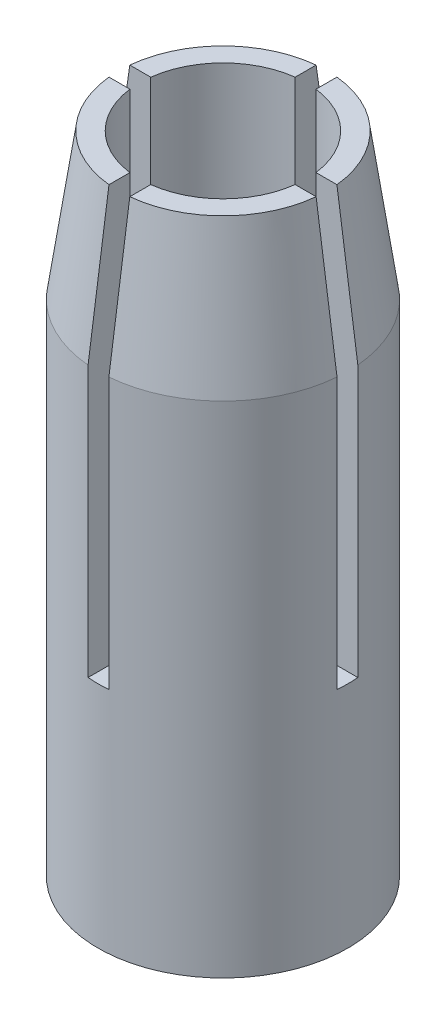
ISO-10303-21;
HEADER;
FILE_DESCRIPTION(('STEP AP214'),'2;1');
FILE_NAME('part.step','',(''),(''),'','','');
FILE_SCHEMA(('AUTOMOTIVE_DESIGN { 1 0 10303 214 1 1 1 1 }'));
ENDSEC;
DATA;
#1=APPLICATION_CONTEXT('core data for automotive mechanical design processes');
#2=APPLICATION_PROTOCOL_DEFINITION('international standard','automotive_design',2000,#1);
#3=PRODUCT_CONTEXT('',#1,'mechanical');
#4=PRODUCT('Part','Part','',(#3));
#5=PRODUCT_RELATED_PRODUCT_CATEGORY('part','',(#4));
#6=PRODUCT_DEFINITION_FORMATION('','',#4);
#7=PRODUCT_DEFINITION_CONTEXT('part definition',#1,'design');
#8=PRODUCT_DEFINITION('design','',#6,#7);
#9=PRODUCT_DEFINITION_SHAPE('','',#8);
#10=(LENGTH_UNIT() NAMED_UNIT(*) SI_UNIT(.MILLI.,.METRE.));
#11=(NAMED_UNIT(*) PLANE_ANGLE_UNIT() SI_UNIT($,.RADIAN.));
#12=(NAMED_UNIT(*) SI_UNIT($,.STERADIAN.) SOLID_ANGLE_UNIT());
#13=UNCERTAINTY_MEASURE_WITH_UNIT(LENGTH_MEASURE(1.E-05),#10,'distance_accuracy_value','');
#14=(GEOMETRIC_REPRESENTATION_CONTEXT(3) GLOBAL_UNCERTAINTY_ASSIGNED_CONTEXT((#13)) GLOBAL_UNIT_ASSIGNED_CONTEXT((#10,
#11,#12)) REPRESENTATION_CONTEXT('',''));
#15=CARTESIAN_POINT('',(0.,0.,0.));
#16=DIRECTION('',(0.,0.,1.));
#17=DIRECTION('',(1.,0.,0.));
#18=AXIS2_PLACEMENT_3D('',#15,#16,#17);
#19=CARTESIAN_POINT('',(0.,5.5,0.));
#20=DIRECTION('',(0.,1.,0.));
#21=DIRECTION('',(0.,0.,1.));
#22=AXIS2_PLACEMENT_3D('',#19,#20,#21);
#23=PLANE('',#22);
#24=CARTESIAN_POINT('',(0.,5.5,0.));
#25=DIRECTION('',(0.,1.,0.));
#26=DIRECTION('',(0.,0.,1.));
#27=AXIS2_PLACEMENT_3D('',#24,#25,#26);
#28=CIRCLE('',#27,2.);
#29=CARTESIAN_POINT('',(1.98431348329844,5.5,0.25));
#30=VERTEX_POINT('',#29);
#31=CARTESIAN_POINT('',(1.98431348329844,5.5,-0.249999999999999));
#32=VERTEX_POINT('',#31);
#33=EDGE_CURVE('E11',#30,#32,#28,.T.);
#34=ORIENTED_EDGE('',*,*,#33,.F.);
#35=DIRECTION('',(1.,0.,0.));
#36=VECTOR('',#35,1.);
#37=CARTESIAN_POINT('',(6.25,5.5,0.25));
#38=LINE('',#37,#36);
#39=CARTESIAN_POINT('',(2.98956518577535,5.5,0.25));
#40=VERTEX_POINT('',#39);
#41=EDGE_CURVE('E326',#30,#40,#38,.T.);
#42=ORIENTED_EDGE('',*,*,#41,.T.);
#43=CARTESIAN_POINT('',(0.,5.5,0.));
#44=DIRECTION('',(0.,1.,0.));
#45=DIRECTION('',(0.,0.,1.));
#46=AXIS2_PLACEMENT_3D('',#43,#44,#45);
#47=CIRCLE('',#46,3.);
#48=CARTESIAN_POINT('',(2.98956518577535,5.5,-0.249999999999999));
#49=VERTEX_POINT('',#48);
#50=EDGE_CURVE('E278',#49,#40,#47,.F.);
#51=ORIENTED_EDGE('',*,*,#50,.F.);
#52=DIRECTION('',(-1.,0.,0.));
#53=VECTOR('',#52,1.);
#54=CARTESIAN_POINT('',(0.25,5.5,-0.25));
#55=LINE('',#54,#53);
#56=EDGE_CURVE('E204',#49,#32,#55,.T.);
#57=ORIENTED_EDGE('',*,*,#56,.T.);
#58=EDGE_LOOP('',(#34,#42,#51,#57));
#59=FACE_BOUND('',#58,.T.);
#60=ADVANCED_FACE('F34',(#59),#23,.T.);
#61=CARTESIAN_POINT('',(0.25,5.5,-1.98431348329844));
#62=VERTEX_POINT('',#61);
#63=CARTESIAN_POINT('',(-0.249999999999999,5.5,-1.98431348329844));
#64=VERTEX_POINT('',#63);
#65=EDGE_CURVE('E43',#62,#64,#28,.T.);
#66=ORIENTED_EDGE('',*,*,#65,.F.);
#67=DIRECTION('',(0.,0.,-1.));
#68=VECTOR('',#67,1.);
#69=CARTESIAN_POINT('',(0.25,5.5,-6.25));
#70=LINE('',#69,#68);
#71=CARTESIAN_POINT('',(0.25,5.5,-2.98956518577535));
#72=VERTEX_POINT('',#71);
#73=EDGE_CURVE('E189',#62,#72,#70,.T.);
#74=ORIENTED_EDGE('',*,*,#73,.T.);
#75=CARTESIAN_POINT('',(-0.249999999999999,5.5,-2.98956518577535));
#76=VERTEX_POINT('',#75);
#77=EDGE_CURVE('E287',#76,#72,#47,.F.);
#78=ORIENTED_EDGE('',*,*,#77,.F.);
#79=DIRECTION('',(0.,0.,1.));
#80=VECTOR('',#79,1.);
#81=CARTESIAN_POINT('',(-0.249999999999999,5.5,-0.25));
#82=LINE('',#81,#80);
#83=EDGE_CURVE('E308',#76,#64,#82,.T.);
#84=ORIENTED_EDGE('',*,*,#83,.T.);
#85=EDGE_LOOP('',(#66,#74,#78,#84));
#86=FACE_BOUND('',#85,.T.);
#87=ADVANCED_FACE('F313',(#86),#23,.T.);
#88=CARTESIAN_POINT('',(-1.98431348329844,5.5,-0.249999999999999));
#89=VERTEX_POINT('',#88);
#90=CARTESIAN_POINT('',(-1.98431348329844,5.5,0.25));
#91=VERTEX_POINT('',#90);
#92=EDGE_CURVE('E299',#89,#91,#28,.T.);
#93=ORIENTED_EDGE('',*,*,#92,.F.);
#94=DIRECTION('',(-1.,0.,0.));
#95=VECTOR('',#94,1.);
#96=CARTESIAN_POINT('',(-6.25,5.5,-0.249999999999999));
#97=LINE('',#96,#95);
#98=CARTESIAN_POINT('',(-2.98956518577535,5.5,-0.249999999999999));
#99=VERTEX_POINT('',#98);
#100=EDGE_CURVE('E315',#89,#99,#97,.T.);
#101=ORIENTED_EDGE('',*,*,#100,.T.);
#102=CARTESIAN_POINT('',(-2.98956518577535,5.5,0.250000000000001));
#103=VERTEX_POINT('',#102);
#104=EDGE_CURVE('E277',#103,#99,#47,.F.);
#105=ORIENTED_EDGE('',*,*,#104,.F.);
#106=DIRECTION('',(1.,0.,0.));
#107=VECTOR('',#106,1.);
#108=CARTESIAN_POINT('',(-0.249999999999999,5.5,0.25));
#109=LINE('',#108,#107);
#110=EDGE_CURVE('E317',#103,#91,#109,.T.);
#111=ORIENTED_EDGE('',*,*,#110,.T.);
#112=EDGE_LOOP('',(#93,#101,#105,#111));
#113=FACE_BOUND('',#112,.T.);
#114=ADVANCED_FACE('F428',(#113),#23,.T.);
#115=CARTESIAN_POINT('',(0.,15.5,0.));
#116=DIRECTION('',(0.,1.,0.));
#117=DIRECTION('',(0.,0.,1.));
#118=AXIS2_PLACEMENT_3D('',#115,#116,#117);
#119=PLANE('',#118);
#120=CARTESIAN_POINT('',(0.,15.5,0.));
#121=DIRECTION('',(0.,-1.,0.));
#122=DIRECTION('',(0.,0.,-1.));
#123=AXIS2_PLACEMENT_3D('',#120,#121,#122);
#124=CIRCLE('',#123,2.);
#125=CARTESIAN_POINT('',(0.25,15.5,-1.98431348329844));
#126=VERTEX_POINT('',#125);
#127=CARTESIAN_POINT('',(1.98431348329844,15.5,-0.249999999999999));
#128=VERTEX_POINT('',#127);
#129=EDGE_CURVE('E169',#126,#128,#124,.T.);
#130=ORIENTED_EDGE('',*,*,#129,.T.);
#131=DIRECTION('',(-1.,0.,0.));
#132=VECTOR('',#131,1.);
#133=CARTESIAN_POINT('',(0.25,15.5,-0.25));
#134=LINE('',#133,#132);
#135=CARTESIAN_POINT('',(2.48746859276655,15.5,-0.249999999999999));
#136=VERTEX_POINT('',#135);
#137=EDGE_CURVE('E218',#136,#128,#134,.T.);
#138=ORIENTED_EDGE('',*,*,#137,.F.);
#139=CARTESIAN_POINT('',(0.,15.5,0.));
#140=DIRECTION('',(0.,-1.,0.));
#141=DIRECTION('',(0.,0.,-1.));
#142=AXIS2_PLACEMENT_3D('',#139,#140,#141);
#143=CIRCLE('',#142,2.5);
#144=CARTESIAN_POINT('',(0.25,15.5,-2.48746859276655));
#145=VERTEX_POINT('',#144);
#146=EDGE_CURVE('E196',#145,#136,#143,.T.);
#147=ORIENTED_EDGE('',*,*,#146,.F.);
#148=DIRECTION('',(0.,0.,-1.));
#149=VECTOR('',#148,1.);
#150=CARTESIAN_POINT('',(0.25,15.5,-6.25));
#151=LINE('',#150,#149);
#152=EDGE_CURVE('E186',#126,#145,#151,.T.);
#153=ORIENTED_EDGE('',*,*,#152,.F.);
#154=EDGE_LOOP('',(#130,#138,#147,#153));
#155=FACE_BOUND('',#154,.T.);
#156=ADVANCED_FACE('F194',(#155),#119,.T.);
#157=CARTESIAN_POINT('',(1.98431348329844,15.5,0.25));
#158=VERTEX_POINT('',#157);
#159=CARTESIAN_POINT('',(0.25,15.5,1.98431348329844));
#160=VERTEX_POINT('',#159);
#161=EDGE_CURVE('E180',#158,#160,#124,.T.);
#162=ORIENTED_EDGE('',*,*,#161,.T.);
#163=DIRECTION('',(0.,0.,-1.));
#164=VECTOR('',#163,1.);
#165=CARTESIAN_POINT('',(0.25,15.5,0.25));
#166=LINE('',#165,#164);
#167=CARTESIAN_POINT('',(0.25,15.5,2.48746859276655));
#168=VERTEX_POINT('',#167);
#169=EDGE_CURVE('E213',#168,#160,#166,.T.);
#170=ORIENTED_EDGE('',*,*,#169,.F.);
#171=CARTESIAN_POINT('',(2.48746859276655,15.5,0.25));
#172=VERTEX_POINT('',#171);
#173=EDGE_CURVE('E273',#172,#168,#143,.T.);
#174=ORIENTED_EDGE('',*,*,#173,.F.);
#175=DIRECTION('',(1.,0.,0.));
#176=VECTOR('',#175,1.);
#177=CARTESIAN_POINT('',(6.25,15.5,0.25));
#178=LINE('',#177,#176);
#179=EDGE_CURVE('E216',#158,#172,#178,.T.);
#180=ORIENTED_EDGE('',*,*,#179,.F.);
#181=EDGE_LOOP('',(#162,#170,#174,#180));
#182=FACE_BOUND('',#181,.T.);
#183=ADVANCED_FACE('F412',(#182),#119,.T.);
#184=CARTESIAN_POINT('',(-0.249999999999999,15.5,1.98431348329844));
#185=VERTEX_POINT('',#184);
#186=CARTESIAN_POINT('',(-1.98431348329844,15.5,0.25));
#187=VERTEX_POINT('',#186);
#188=EDGE_CURVE('E415',#185,#187,#124,.T.);
#189=ORIENTED_EDGE('',*,*,#188,.T.);
#190=DIRECTION('',(1.,0.,0.));
#191=VECTOR('',#190,1.);
#192=CARTESIAN_POINT('',(-0.249999999999999,15.5,0.25));
#193=LINE('',#192,#191);
#194=CARTESIAN_POINT('',(-2.48746859276655,15.5,0.250000000000001));
#195=VERTEX_POINT('',#194);
#196=EDGE_CURVE('E208',#195,#187,#193,.T.);
#197=ORIENTED_EDGE('',*,*,#196,.F.);
#198=CARTESIAN_POINT('',(-0.249999999999999,15.5,2.48746859276655));
#199=VERTEX_POINT('',#198);
#200=EDGE_CURVE('E430',#199,#195,#143,.T.);
#201=ORIENTED_EDGE('',*,*,#200,.F.);
#202=DIRECTION('',(0.,0.,1.));
#203=VECTOR('',#202,1.);
#204=CARTESIAN_POINT('',(-0.249999999999999,15.5,6.25));
#205=LINE('',#204,#203);
#206=EDGE_CURVE('E211',#185,#199,#205,.T.);
#207=ORIENTED_EDGE('',*,*,#206,.F.);
#208=EDGE_LOOP('',(#189,#197,#201,#207));
#209=FACE_BOUND('',#208,.T.);
#210=ADVANCED_FACE('F438',(#209),#119,.T.);
#211=CARTESIAN_POINT('',(0.,12.,0.));
#212=DIRECTION('',(0.,-1.,0.));
#213=DIRECTION('',(0.,0.,-1.));
#214=AXIS2_PLACEMENT_3D('',#211,#212,#213);
#215=CONICAL_SURFACE('',#214,3.,0.141897054604164);
#216=CARTESIAN_POINT('',(0.25,17.5974181034012,-2.18612054619095));
#217=CARTESIAN_POINT('',(0.25,16.3253345447487,-2.36900749170544));
#218=CARTESIAN_POINT('',(0.25,15.0532172360124,-2.55165936364087));
#219=CARTESIAN_POINT('',(0.25,13.3620493745075,-2.79426649400318));
#220=CARTESIAN_POINT('',(0.25,12.9430188500199,-2.85436134005573));
#221=CARTESIAN_POINT('',(0.25,10.8328004035789,-3.15692332874558));
#222=CARTESIAN_POINT('',(0.25,9.14158138153774,-3.39917363737321));
#223=CARTESIAN_POINT('',(0.25,7.45035573658055,-3.64137735206729));
#224=B_SPLINE_CURVE_WITH_KNOTS('',3,(#216,#217,#218,#219,#220,#221,#222,#223),.UNSPECIFIED.,.F.,
.F.,(4,2,2,4),(0.,3.85548924063714,5.12544267930526,10.2508852950475),.UNSPECIFIED.);
#225=CARTESIAN_POINT('',(0.25,12.,-2.98956518577535));
#226=VERTEX_POINT('',#225);
#227=EDGE_CURVE('E250',#145,#226,#224,.T.);
#228=ORIENTED_EDGE('',*,*,#227,.F.);
#229=ORIENTED_EDGE('',*,*,#146,.T.);
#230=CARTESIAN_POINT('',(3.64137735206729,7.45035573658055,-0.249999999999999));
#231=CARTESIAN_POINT('',(3.52028937255365,8.29597056504085,-0.249999999999999));
#232=CARTESIAN_POINT('',(3.39917658861142,9.14158184315956,-0.249999999999999));
#233=CARTESIAN_POINT('',(3.1568739578554,10.8327933417464,-0.249999999999999));
#234=CARTESIAN_POINT('',(3.03568411104306,11.6783935622148,-0.249999999999999));
#235=CARTESIAN_POINT('',(2.79319989441477,13.3695790312572,-0.249999999999999));
#236=CARTESIAN_POINT('',(2.67190552459748,14.215164279831,-0.249999999999999));
#237=CARTESIAN_POINT('',(2.4291518444079,15.9063111155802,-0.249999999999999));
#238=CARTESIAN_POINT('',(2.3076925340324,16.7518727027551,-0.249999999999999));
#239=CARTESIAN_POINT('',(2.18612054619095,17.5974181034012,-0.249999999999999));
#240=B_SPLINE_CURVE_WITH_KNOTS('',3,(#230,#231,#232,#233,#234,#235,#236,#237,#238,#239),
.UNSPECIFIED.,.F.,.F.,(4,2,2,2,4),(0.,2.56272133473702,5.12544262106358,7.6881639400474,
10.2508853089314),.UNSPECIFIED.);
#241=CARTESIAN_POINT('',(2.98956518577535,12.,-0.249999999999999));
#242=VERTEX_POINT('',#241);
#243=EDGE_CURVE('E257',#242,#136,#240,.T.);
#244=ORIENTED_EDGE('',*,*,#243,.F.);
#245=CARTESIAN_POINT('',(0.,12.,0.));
#246=DIRECTION('',(0.,-1.,0.));
#247=DIRECTION('',(0.,0.,-1.));
#248=AXIS2_PLACEMENT_3D('',#245,#246,#247);
#249=CIRCLE('',#248,3.);
#250=EDGE_CURVE('E266',#226,#242,#249,.T.);
#251=ORIENTED_EDGE('',*,*,#250,.F.);
#252=EDGE_LOOP('',(#228,#229,#244,#251));
#253=FACE_BOUND('',#252,.T.);
#254=ADVANCED_FACE('F343',(#253),#215,.T.);
#255=CARTESIAN_POINT('',(2.18612054619095,17.5974181034012,0.25));
#256=CARTESIAN_POINT('',(2.36900749170544,16.3253345447487,0.25));
#257=CARTESIAN_POINT('',(2.55165936364087,15.0532172360124,0.25));
#258=CARTESIAN_POINT('',(2.79426649400318,13.3620493745075,0.25));
#259=CARTESIAN_POINT('',(2.85436134005573,12.9430188500199,0.25));
#260=CARTESIAN_POINT('',(3.15692332874558,10.8328004035789,0.25));
#261=CARTESIAN_POINT('',(3.39917363737321,9.14158138153774,0.25));
#262=CARTESIAN_POINT('',(3.64137735206729,7.45035573658055,0.25));
#263=B_SPLINE_CURVE_WITH_KNOTS('',3,(#255,#256,#257,#258,#259,#260,#261,#262),.UNSPECIFIED.,.F.,
.F.,(4,2,2,4),(0.,3.85548924063714,5.12544267930526,10.2508852950475),.UNSPECIFIED.);
#264=CARTESIAN_POINT('',(2.98956518577535,12.,0.25));
#265=VERTEX_POINT('',#264);
#266=EDGE_CURVE('E344',#172,#265,#263,.T.);
#267=ORIENTED_EDGE('',*,*,#266,.F.);
#268=ORIENTED_EDGE('',*,*,#173,.T.);
#269=CARTESIAN_POINT('',(0.25,7.45035573658055,3.64137735206729));
#270=CARTESIAN_POINT('',(0.25,8.29597056504085,3.52028937255365));
#271=CARTESIAN_POINT('',(0.25,9.14158184315956,3.39917658861142));
#272=CARTESIAN_POINT('',(0.25,10.8327933417464,3.1568739578554));
#273=CARTESIAN_POINT('',(0.25,11.6783935622148,3.03568411104306));
#274=CARTESIAN_POINT('',(0.25,13.3695790312572,2.79319989441477));
#275=CARTESIAN_POINT('',(0.25,14.215164279831,2.67190552459748));
#276=CARTESIAN_POINT('',(0.25,15.9063111155802,2.4291518444079));
#277=CARTESIAN_POINT('',(0.25,16.7518727027551,2.3076925340324));
#278=CARTESIAN_POINT('',(0.25,17.5974181034012,2.18612054619095));
#279=B_SPLINE_CURVE_WITH_KNOTS('',3,(#269,#270,#271,#272,#273,#274,#275,#276,#277,#278),
.UNSPECIFIED.,.F.,.F.,(4,2,2,2,4),(0.,2.56272133473702,5.12544262106358,7.6881639400474,
10.2508853089314),.UNSPECIFIED.);
#280=CARTESIAN_POINT('',(0.25,12.,2.98956518577535));
#281=VERTEX_POINT('',#280);
#282=EDGE_CURVE('E345',#281,#168,#279,.T.);
#283=ORIENTED_EDGE('',*,*,#282,.F.);
#284=EDGE_CURVE('E270',#265,#281,#249,.T.);
#285=ORIENTED_EDGE('',*,*,#284,.F.);
#286=EDGE_LOOP('',(#267,#268,#283,#285));
#287=FACE_BOUND('',#286,.T.);
#288=ADVANCED_FACE('F405',(#287),#215,.T.);
#289=CARTESIAN_POINT('',(-0.249999999999999,17.5974181034012,2.18612054619095));
#290=CARTESIAN_POINT('',(-0.249999999999999,16.3253345447487,2.36900749170544));
#291=CARTESIAN_POINT('',(-0.249999999999999,15.0532172360124,2.55165936364087));
#292=CARTESIAN_POINT('',(-0.249999999999999,13.3620493745075,2.79426649400318));
#293=CARTESIAN_POINT('',(-0.249999999999999,12.9430188500199,2.85436134005573));
#294=CARTESIAN_POINT('',(-0.249999999999999,10.8328004035789,3.15692332874558));
#295=CARTESIAN_POINT('',(-0.249999999999999,9.14158138153774,3.39917363737321));
#296=CARTESIAN_POINT('',(-0.249999999999999,7.45035573658055,3.64137735206729));
#297=B_SPLINE_CURVE_WITH_KNOTS('',3,(#289,#290,#291,#292,#293,#294,#295,#296),.UNSPECIFIED.,.F.,
.F.,(4,2,2,4),(0.,3.85548924063714,5.12544267930526,10.2508852950475),.UNSPECIFIED.);
#298=CARTESIAN_POINT('',(-0.249999999999999,12.,2.98956518577535));
#299=VERTEX_POINT('',#298);
#300=EDGE_CURVE('E348',#199,#299,#297,.T.);
#301=ORIENTED_EDGE('',*,*,#300,.F.);
#302=ORIENTED_EDGE('',*,*,#200,.T.);
#303=CARTESIAN_POINT('',(-3.64137735206729,7.45035573658055,0.250000000000001));
#304=CARTESIAN_POINT('',(-3.52028937255365,8.29597056504085,0.250000000000001));
#305=CARTESIAN_POINT('',(-3.39917658861142,9.14158184315956,0.250000000000001));
#306=CARTESIAN_POINT('',(-3.1568739578554,10.8327933417464,0.250000000000001));
#307=CARTESIAN_POINT('',(-3.03568411104306,11.6783935622148,0.250000000000001));
#308=CARTESIAN_POINT('',(-2.79319989441477,13.3695790312572,0.250000000000001));
#309=CARTESIAN_POINT('',(-2.67190552459748,14.215164279831,0.250000000000001));
#310=CARTESIAN_POINT('',(-2.4291518444079,15.9063111155802,0.250000000000001));
#311=CARTESIAN_POINT('',(-2.3076925340324,16.7518727027551,0.250000000000001));
#312=CARTESIAN_POINT('',(-2.18612054619095,17.5974181034012,0.25));
#313=B_SPLINE_CURVE_WITH_KNOTS('',3,(#303,#304,#305,#306,#307,#308,#309,#310,#311,#312),
.UNSPECIFIED.,.F.,.F.,(4,2,2,2,4),(0.,2.56272133473702,5.12544262106358,7.6881639400474,
10.2508853089314),.UNSPECIFIED.);
#314=CARTESIAN_POINT('',(-2.98956518577535,12.,0.250000000000001));
#315=VERTEX_POINT('',#314);
#316=EDGE_CURVE('E378',#315,#195,#313,.T.);
#317=ORIENTED_EDGE('',*,*,#316,.F.);
#318=EDGE_CURVE('E396',#299,#315,#249,.T.);
#319=ORIENTED_EDGE('',*,*,#318,.F.);
#320=EDGE_LOOP('',(#301,#302,#317,#319));
#321=FACE_BOUND('',#320,.T.);
#322=ADVANCED_FACE('F435',(#321),#215,.T.);
#323=CARTESIAN_POINT('',(-1.98431348329844,15.5,-0.249999999999999));
#324=VERTEX_POINT('',#323);
#325=CARTESIAN_POINT('',(-0.249999999999999,15.5,-1.98431348329844));
#326=VERTEX_POINT('',#325);
#327=EDGE_CURVE('E182',#324,#326,#124,.T.);
#328=ORIENTED_EDGE('',*,*,#327,.T.);
#329=DIRECTION('',(0.,0.,1.));
#330=VECTOR('',#329,1.);
#331=CARTESIAN_POINT('',(-0.249999999999999,15.5,-0.25));
#332=LINE('',#331,#330);
#333=CARTESIAN_POINT('',(-0.249999999999999,15.5,-2.48746859276655));
#334=VERTEX_POINT('',#333);
#335=EDGE_CURVE('E197',#334,#326,#332,.T.);
#336=ORIENTED_EDGE('',*,*,#335,.F.);
#337=CARTESIAN_POINT('',(-2.48746859276655,15.5,-0.249999999999999));
#338=VERTEX_POINT('',#337);
#339=EDGE_CURVE('E269',#338,#334,#143,.T.);
#340=ORIENTED_EDGE('',*,*,#339,.F.);
#341=DIRECTION('',(-1.,0.,0.));
#342=VECTOR('',#341,1.);
#343=CARTESIAN_POINT('',(-6.25,15.5,-0.249999999999999));
#344=LINE('',#343,#342);
#345=EDGE_CURVE('E200',#324,#338,#344,.T.);
#346=ORIENTED_EDGE('',*,*,#345,.F.);
#347=EDGE_LOOP('',(#328,#336,#340,#346));
#348=FACE_BOUND('',#347,.T.);
#349=ADVANCED_FACE('F36',(#348),#119,.T.);
#350=CARTESIAN_POINT('',(-2.18612054619095,17.5974181034012,-0.249999999999999));
#351=CARTESIAN_POINT('',(-2.36900749170544,16.3253345447487,-0.249999999999999));
#352=CARTESIAN_POINT('',(-2.55165936364087,15.0532172360124,-0.249999999999999));
#353=CARTESIAN_POINT('',(-2.79426649400318,13.3620493745075,-0.249999999999999));
#354=CARTESIAN_POINT('',(-2.85436134005573,12.9430188500199,-0.249999999999999));
#355=CARTESIAN_POINT('',(-3.15692332874558,10.8328004035789,-0.249999999999999));
#356=CARTESIAN_POINT('',(-3.39917363737321,9.14158138153774,-0.249999999999999));
#357=CARTESIAN_POINT('',(-3.64137735206729,7.45035573658055,-0.249999999999999));
#358=B_SPLINE_CURVE_WITH_KNOTS('',3,(#350,#351,#352,#353,#354,#355,#356,#357),.UNSPECIFIED.,.F.,
.F.,(4,2,2,4),(0.,3.85548924063714,5.12544267930526,10.2508852950475),.UNSPECIFIED.);
#359=CARTESIAN_POINT('',(-2.98956518577535,12.,-0.249999999999999));
#360=VERTEX_POINT('',#359);
#361=EDGE_CURVE('E226',#338,#360,#358,.T.);
#362=ORIENTED_EDGE('',*,*,#361,.F.);
#363=ORIENTED_EDGE('',*,*,#339,.T.);
#364=CARTESIAN_POINT('',(-0.249999999999999,7.45035573658055,-3.64137735206729));
#365=CARTESIAN_POINT('',(-0.249999999999999,8.29597056504085,-3.52028937255365));
#366=CARTESIAN_POINT('',(-0.249999999999999,9.14158184315956,-3.39917658861142));
#367=CARTESIAN_POINT('',(-0.249999999999999,10.8327933417464,-3.1568739578554));
#368=CARTESIAN_POINT('',(-0.249999999999999,11.6783935622148,-3.03568411104306));
#369=CARTESIAN_POINT('',(-0.249999999999999,13.3695790312572,-2.79319989441477));
#370=CARTESIAN_POINT('',(-0.249999999999999,14.215164279831,-2.67190552459748));
#371=CARTESIAN_POINT('',(-0.249999999999999,15.9063111155802,-2.4291518444079));
#372=CARTESIAN_POINT('',(-0.249999999999999,16.7518727027551,-2.3076925340324));
#373=CARTESIAN_POINT('',(-0.249999999999999,17.5974181034012,-2.18612054619095));
#374=B_SPLINE_CURVE_WITH_KNOTS('',3,(#364,#365,#366,#367,#368,#369,#370,#371,#372,#373),
.UNSPECIFIED.,.F.,.F.,(4,2,2,2,4),(0.,2.56272133473702,5.12544262106358,7.6881639400474,
10.2508853089314),.UNSPECIFIED.);
#375=CARTESIAN_POINT('',(-0.249999999999999,12.,-2.98956518577535));
#376=VERTEX_POINT('',#375);
#377=EDGE_CURVE('E220',#376,#334,#374,.T.);
#378=ORIENTED_EDGE('',*,*,#377,.F.);
#379=EDGE_CURVE('E265',#360,#376,#249,.T.);
#380=ORIENTED_EDGE('',*,*,#379,.F.);
#381=EDGE_LOOP('',(#362,#363,#378,#380));
#382=FACE_BOUND('',#381,.T.);
#383=ADVANCED_FACE('F232',(#382),#215,.T.);
#384=CARTESIAN_POINT('',(0.,0.,0.));
#385=DIRECTION('',(0.,-1.,0.));
#386=DIRECTION('',(0.,0.,-1.));
#387=AXIS2_PLACEMENT_3D('',#384,#385,#386);
#388=CYLINDRICAL_SURFACE('',#387,3.);
#389=DIRECTION('',(0.,-1.,0.));
#390=VECTOR('',#389,1.);
#391=CARTESIAN_POINT('',(-2.98956518577535,0.,0.250000000000001));
#392=LINE('',#391,#390);
#393=EDGE_CURVE('E294',#103,#315,#392,.F.);
#394=ORIENTED_EDGE('',*,*,#393,.F.);
#395=ORIENTED_EDGE('',*,*,#104,.T.);
#396=DIRECTION('',(0.,-1.,0.));
#397=VECTOR('',#396,1.);
#398=CARTESIAN_POINT('',(-2.98956518577535,0.,-0.249999999999999));
#399=LINE('',#398,#397);
#400=EDGE_CURVE('E292',#360,#99,#399,.T.);
#401=ORIENTED_EDGE('',*,*,#400,.F.);
#402=ORIENTED_EDGE('',*,*,#379,.T.);
#403=DIRECTION('',(0.,-1.,0.));
#404=VECTOR('',#403,1.);
#405=CARTESIAN_POINT('',(-0.249999999999999,0.,-2.98956518577535));
#406=LINE('',#405,#404);
#407=EDGE_CURVE('E288',#76,#376,#406,.F.);
#408=ORIENTED_EDGE('',*,*,#407,.F.);
#409=ORIENTED_EDGE('',*,*,#77,.T.);
#410=DIRECTION('',(0.,-1.,0.));
#411=VECTOR('',#410,1.);
#412=CARTESIAN_POINT('',(0.25,0.,-2.98956518577535));
#413=LINE('',#412,#411);
#414=EDGE_CURVE('E290',#226,#72,#413,.T.);
#415=ORIENTED_EDGE('',*,*,#414,.F.);
#416=ORIENTED_EDGE('',*,*,#250,.T.);
#417=DIRECTION('',(0.,-1.,0.));
#418=VECTOR('',#417,1.);
#419=CARTESIAN_POINT('',(2.98956518577535,0.,-0.249999999999999));
#420=LINE('',#419,#418);
#421=EDGE_CURVE('E285',#49,#242,#420,.F.);
#422=ORIENTED_EDGE('',*,*,#421,.F.);
#423=ORIENTED_EDGE('',*,*,#50,.T.);
#424=DIRECTION('',(0.,-1.,0.));
#425=VECTOR('',#424,1.);
#426=CARTESIAN_POINT('',(2.98956518577535,0.,0.25));
#427=LINE('',#426,#425);
#428=EDGE_CURVE('E282',#265,#40,#427,.T.);
#429=ORIENTED_EDGE('',*,*,#428,.F.);
#430=ORIENTED_EDGE('',*,*,#284,.T.);
#431=DIRECTION('',(0.,-1.,0.));
#432=VECTOR('',#431,1.);
#433=CARTESIAN_POINT('',(0.25,0.,2.98956518577535));
#434=LINE('',#433,#432);
#435=CARTESIAN_POINT('',(0.25,5.5,2.98956518577535));
#436=VERTEX_POINT('',#435);
#437=EDGE_CURVE('E280',#436,#281,#434,.F.);
#438=ORIENTED_EDGE('',*,*,#437,.F.);
#439=CARTESIAN_POINT('',(-0.249999999999999,5.5,2.98956518577535));
#440=VERTEX_POINT('',#439);
#441=EDGE_CURVE('E272',#436,#440,#47,.F.);
#442=ORIENTED_EDGE('',*,*,#441,.T.);
#443=DIRECTION('',(0.,-1.,0.));
#444=VECTOR('',#443,1.);
#445=CARTESIAN_POINT('',(-0.249999999999999,0.,2.98956518577535));
#446=LINE('',#445,#444);
#447=EDGE_CURVE('E276',#299,#440,#446,.T.);
#448=ORIENTED_EDGE('',*,*,#447,.F.);
#449=ORIENTED_EDGE('',*,*,#318,.T.);
#450=EDGE_LOOP('',(#394,#395,#401,#402,#408,#409,#415,#416,#422,#423,#429,#430,#438,#442,#448,#449));
#451=FACE_BOUND('',#450,.T.);
#452=CARTESIAN_POINT('',(0.,0.,0.));
#453=DIRECTION('',(0.,-1.,0.));
#454=DIRECTION('',(0.,0.,-1.));
#455=AXIS2_PLACEMENT_3D('',#452,#453,#454);
#456=CIRCLE('',#455,3.);
#457=CARTESIAN_POINT('',(0.,0.,-3.));
#458=VERTEX_POINT('',#457);
#459=EDGE_CURVE('E256',#458,#458,#456,.T.);
#460=ORIENTED_EDGE('',*,*,#459,.F.);
#461=EDGE_LOOP('',(#460));
#462=FACE_BOUND('',#461,.T.);
#463=ADVANCED_FACE('F337',(#451,#462),#388,.T.);
#464=CARTESIAN_POINT('',(3.,0.,0.));
#465=DIRECTION('',(0.,-1.,0.));
#466=DIRECTION('',(0.,0.,-1.));
#467=AXIS2_PLACEMENT_3D('',#464,#465,#466);
#468=PLANE('',#467);
#469=CARTESIAN_POINT('',(0.,0.,0.));
#470=DIRECTION('',(0.,-1.,0.));
#471=DIRECTION('',(0.,0.,-1.));
#472=AXIS2_PLACEMENT_3D('',#469,#470,#471);
#473=CIRCLE('',#472,2.);
#474=CARTESIAN_POINT('',(0.,0.,-2.));
#475=VERTEX_POINT('',#474);
#476=EDGE_CURVE('E418',#475,#475,#473,.T.);
#477=ORIENTED_EDGE('',*,*,#476,.F.);
#478=EDGE_LOOP('',(#477));
#479=FACE_BOUND('',#478,.T.);
#480=ORIENTED_EDGE('',*,*,#459,.T.);
#481=EDGE_LOOP('',(#480));
#482=FACE_BOUND('',#481,.T.);
#483=ADVANCED_FACE('F248',(#479,#482),#468,.T.);
#484=CARTESIAN_POINT('',(0.25,5.5,-6.25));
#485=DIRECTION('',(1.,0.,0.));
#486=DIRECTION('',(0.,0.,-1.));
#487=AXIS2_PLACEMENT_3D('',#484,#485,#486);
#488=PLANE('',#487);
#489=ORIENTED_EDGE('',*,*,#73,.F.);
#490=DIRECTION('',(0.,-1.,0.));
#491=VECTOR('',#490,1.);
#492=CARTESIAN_POINT('',(0.25,15.5,-1.98431348329844));
#493=LINE('',#492,#491);
#494=EDGE_CURVE('E172',#62,#126,#493,.F.);
#495=ORIENTED_EDGE('',*,*,#494,.T.);
#496=ORIENTED_EDGE('',*,*,#152,.T.);
#497=ORIENTED_EDGE('',*,*,#227,.T.);
#498=ORIENTED_EDGE('',*,*,#414,.T.);
#499=EDGE_LOOP('',(#489,#495,#496,#497,#498));
#500=FACE_BOUND('',#499,.T.);
#501=ADVANCED_FACE('F185',(#500),#488,.F.);
#502=CARTESIAN_POINT('',(0.25,5.5,-0.25));
#503=DIRECTION('',(0.,0.,-1.));
#504=DIRECTION('',(-1.,0.,0.));
#505=AXIS2_PLACEMENT_3D('',#502,#503,#504);
#506=PLANE('',#505);
#507=ORIENTED_EDGE('',*,*,#137,.T.);
#508=DIRECTION('',(0.,-1.,0.));
#509=VECTOR('',#508,1.);
#510=CARTESIAN_POINT('',(1.98431348329844,15.5,-0.249999999999999));
#511=LINE('',#510,#509);
#512=EDGE_CURVE('E175',#128,#32,#511,.T.);
#513=ORIENTED_EDGE('',*,*,#512,.T.);
#514=ORIENTED_EDGE('',*,*,#56,.F.);
#515=ORIENTED_EDGE('',*,*,#421,.T.);
#516=ORIENTED_EDGE('',*,*,#243,.T.);
#517=EDGE_LOOP('',(#507,#513,#514,#515,#516));
#518=FACE_BOUND('',#517,.T.);
#519=ADVANCED_FACE('F247',(#518),#506,.F.);
#520=CARTESIAN_POINT('',(6.25,5.5,0.25));
#521=DIRECTION('',(0.,0.,1.));
#522=DIRECTION('',(1.,0.,0.));
#523=AXIS2_PLACEMENT_3D('',#520,#521,#522);
#524=PLANE('',#523);
#525=ORIENTED_EDGE('',*,*,#41,.F.);
#526=DIRECTION('',(0.,-1.,0.));
#527=VECTOR('',#526,1.);
#528=CARTESIAN_POINT('',(1.98431348329844,15.5,0.25));
#529=LINE('',#528,#527);
#530=EDGE_CURVE('E190',#30,#158,#529,.F.);
#531=ORIENTED_EDGE('',*,*,#530,.T.);
#532=ORIENTED_EDGE('',*,*,#179,.T.);
#533=ORIENTED_EDGE('',*,*,#266,.T.);
#534=ORIENTED_EDGE('',*,*,#428,.T.);
#535=EDGE_LOOP('',(#525,#531,#532,#533,#534));
#536=FACE_BOUND('',#535,.T.);
#537=ADVANCED_FACE('F359',(#536),#524,.F.);
#538=CARTESIAN_POINT('',(0.25,5.5,0.25));
#539=DIRECTION('',(1.,0.,0.));
#540=DIRECTION('',(0.,0.,-1.));
#541=AXIS2_PLACEMENT_3D('',#538,#539,#540);
#542=PLANE('',#541);
#543=ORIENTED_EDGE('',*,*,#169,.T.);
#544=DIRECTION('',(0.,-1.,0.));
#545=VECTOR('',#544,1.);
#546=CARTESIAN_POINT('',(0.25,15.5,1.98431348329844));
#547=LINE('',#546,#545);
#548=CARTESIAN_POINT('',(0.25,5.5,1.98431348329844));
#549=VERTEX_POINT('',#548);
#550=EDGE_CURVE('E422',#160,#549,#547,.T.);
#551=ORIENTED_EDGE('',*,*,#550,.T.);
#552=DIRECTION('',(0.,0.,-1.));
#553=VECTOR('',#552,1.);
#554=CARTESIAN_POINT('',(0.25,5.5,0.25));
#555=LINE('',#554,#553);
#556=EDGE_CURVE('E324',#436,#549,#555,.T.);
#557=ORIENTED_EDGE('',*,*,#556,.F.);
#558=ORIENTED_EDGE('',*,*,#437,.T.);
#559=ORIENTED_EDGE('',*,*,#282,.T.);
#560=EDGE_LOOP('',(#543,#551,#557,#558,#559));
#561=FACE_BOUND('',#560,.T.);
#562=ADVANCED_FACE('F362',(#561),#542,.F.);
#563=CARTESIAN_POINT('',(-0.249999999999999,5.5,6.25));
#564=DIRECTION('',(-1.,0.,0.));
#565=DIRECTION('',(0.,0.,1.));
#566=AXIS2_PLACEMENT_3D('',#563,#564,#565);
#567=PLANE('',#566);
#568=DIRECTION('',(0.,0.,1.));
#569=VECTOR('',#568,1.);
#570=CARTESIAN_POINT('',(-0.249999999999999,5.5,6.25));
#571=LINE('',#570,#569);
#572=CARTESIAN_POINT('',(-0.249999999999999,5.5,1.98431348329844));
#573=VERTEX_POINT('',#572);
#574=EDGE_CURVE('E57',#573,#440,#571,.T.);
#575=ORIENTED_EDGE('',*,*,#574,.F.);
#576=DIRECTION('',(0.,-1.,0.));
#577=VECTOR('',#576,1.);
#578=CARTESIAN_POINT('',(-0.249999999999999,15.5,1.98431348329844));
#579=LINE('',#578,#577);
#580=EDGE_CURVE('E50',#573,#185,#579,.F.);
#581=ORIENTED_EDGE('',*,*,#580,.T.);
#582=ORIENTED_EDGE('',*,*,#206,.T.);
#583=ORIENTED_EDGE('',*,*,#300,.T.);
#584=ORIENTED_EDGE('',*,*,#447,.T.);
#585=EDGE_LOOP('',(#575,#581,#582,#583,#584));
#586=FACE_BOUND('',#585,.T.);
#587=ADVANCED_FACE('F368',(#586),#567,.F.);
#588=CARTESIAN_POINT('',(-0.249999999999999,5.5,0.25));
#589=DIRECTION('',(0.,0.,1.));
#590=DIRECTION('',(1.,0.,0.));
#591=AXIS2_PLACEMENT_3D('',#588,#589,#590);
#592=PLANE('',#591);
#593=ORIENTED_EDGE('',*,*,#196,.T.);
#594=DIRECTION('',(0.,-1.,0.));
#595=VECTOR('',#594,1.);
#596=CARTESIAN_POINT('',(-1.98431348329844,15.5,0.25));
#597=LINE('',#596,#595);
#598=EDGE_CURVE('E311',#187,#91,#597,.T.);
#599=ORIENTED_EDGE('',*,*,#598,.T.);
#600=ORIENTED_EDGE('',*,*,#110,.F.);
#601=ORIENTED_EDGE('',*,*,#393,.T.);
#602=ORIENTED_EDGE('',*,*,#316,.T.);
#603=EDGE_LOOP('',(#593,#599,#600,#601,#602));
#604=FACE_BOUND('',#603,.T.);
#605=ADVANCED_FACE('F372',(#604),#592,.F.);
#606=CARTESIAN_POINT('',(-6.25,5.5,-0.249999999999999));
#607=DIRECTION('',(0.,0.,-1.));
#608=DIRECTION('',(-1.,0.,0.));
#609=AXIS2_PLACEMENT_3D('',#606,#607,#608);
#610=PLANE('',#609);
#611=ORIENTED_EDGE('',*,*,#100,.F.);
#612=DIRECTION('',(0.,-1.,0.));
#613=VECTOR('',#612,1.);
#614=CARTESIAN_POINT('',(-1.98431348329844,15.5,-0.249999999999999));
#615=LINE('',#614,#613);
#616=EDGE_CURVE('E424',#89,#324,#615,.F.);
#617=ORIENTED_EDGE('',*,*,#616,.T.);
#618=ORIENTED_EDGE('',*,*,#345,.T.);
#619=ORIENTED_EDGE('',*,*,#361,.T.);
#620=ORIENTED_EDGE('',*,*,#400,.T.);
#621=EDGE_LOOP('',(#611,#617,#618,#619,#620));
#622=FACE_BOUND('',#621,.T.);
#623=ADVANCED_FACE('F240',(#622),#610,.F.);
#624=CARTESIAN_POINT('',(-0.249999999999999,5.5,-0.25));
#625=DIRECTION('',(-1.,0.,0.));
#626=DIRECTION('',(0.,0.,1.));
#627=AXIS2_PLACEMENT_3D('',#624,#625,#626);
#628=PLANE('',#627);
#629=ORIENTED_EDGE('',*,*,#335,.T.);
#630=DIRECTION('',(0.,-1.,0.));
#631=VECTOR('',#630,1.);
#632=CARTESIAN_POINT('',(-0.249999999999999,15.5,-1.98431348329844));
#633=LINE('',#632,#631);
#634=EDGE_CURVE('E191',#326,#64,#633,.T.);
#635=ORIENTED_EDGE('',*,*,#634,.T.);
#636=ORIENTED_EDGE('',*,*,#83,.F.);
#637=ORIENTED_EDGE('',*,*,#407,.T.);
#638=ORIENTED_EDGE('',*,*,#377,.T.);
#639=EDGE_LOOP('',(#629,#635,#636,#637,#638));
#640=FACE_BOUND('',#639,.T.);
#641=ADVANCED_FACE('F235',(#640),#628,.F.);
#642=EDGE_CURVE('E38',#573,#549,#28,.T.);
#643=ORIENTED_EDGE('',*,*,#642,.F.);
#644=ORIENTED_EDGE('',*,*,#574,.T.);
#645=ORIENTED_EDGE('',*,*,#441,.F.);
#646=ORIENTED_EDGE('',*,*,#556,.T.);
#647=EDGE_LOOP('',(#643,#644,#645,#646));
#648=FACE_BOUND('',#647,.T.);
#649=ADVANCED_FACE('F239',(#648),#23,.T.);
#650=CARTESIAN_POINT('',(0.,15.5,0.));
#651=DIRECTION('',(0.,-1.,0.));
#652=DIRECTION('',(0.,0.,-1.));
#653=AXIS2_PLACEMENT_3D('',#650,#651,#652);
#654=CYLINDRICAL_SURFACE('',#653,2.);
#655=ORIENTED_EDGE('',*,*,#476,.T.);
#656=EDGE_LOOP('',(#655));
#657=FACE_BOUND('',#656,.T.);
#658=ORIENTED_EDGE('',*,*,#129,.F.);
#659=ORIENTED_EDGE('',*,*,#494,.F.);
#660=ORIENTED_EDGE('',*,*,#65,.T.);
#661=ORIENTED_EDGE('',*,*,#634,.F.);
#662=ORIENTED_EDGE('',*,*,#327,.F.);
#663=ORIENTED_EDGE('',*,*,#616,.F.);
#664=ORIENTED_EDGE('',*,*,#92,.T.);
#665=ORIENTED_EDGE('',*,*,#598,.F.);
#666=ORIENTED_EDGE('',*,*,#188,.F.);
#667=ORIENTED_EDGE('',*,*,#580,.F.);
#668=ORIENTED_EDGE('',*,*,#642,.T.);
#669=ORIENTED_EDGE('',*,*,#550,.F.);
#670=ORIENTED_EDGE('',*,*,#161,.F.);
#671=ORIENTED_EDGE('',*,*,#530,.F.);
#672=ORIENTED_EDGE('',*,*,#33,.T.);
#673=ORIENTED_EDGE('',*,*,#512,.F.);
#674=EDGE_LOOP('',(#658,#659,#660,#661,#662,#663,#664,#665,#666,#667,#668,#669,#670,#671,#672,#673));
#675=FACE_BOUND('',#674,.T.);
#676=ADVANCED_FACE('F171',(#657,#675),#654,.F.);
#677=CLOSED_SHELL('',(#60,#87,#114,#156,#183,#210,#254,#288,#322,#349,#383,#463,#483,#501,#519,
#537,#562,#587,#605,#623,#641,#649,#676));
#678=MANIFOLD_SOLID_BREP('B2',#677);
#679=ADVANCED_BREP_SHAPE_REPRESENTATION('',(#18,#678),#14);
#680=SHAPE_DEFINITION_REPRESENTATION(#9,#679);
ENDSEC;
END-ISO-10303-21;
